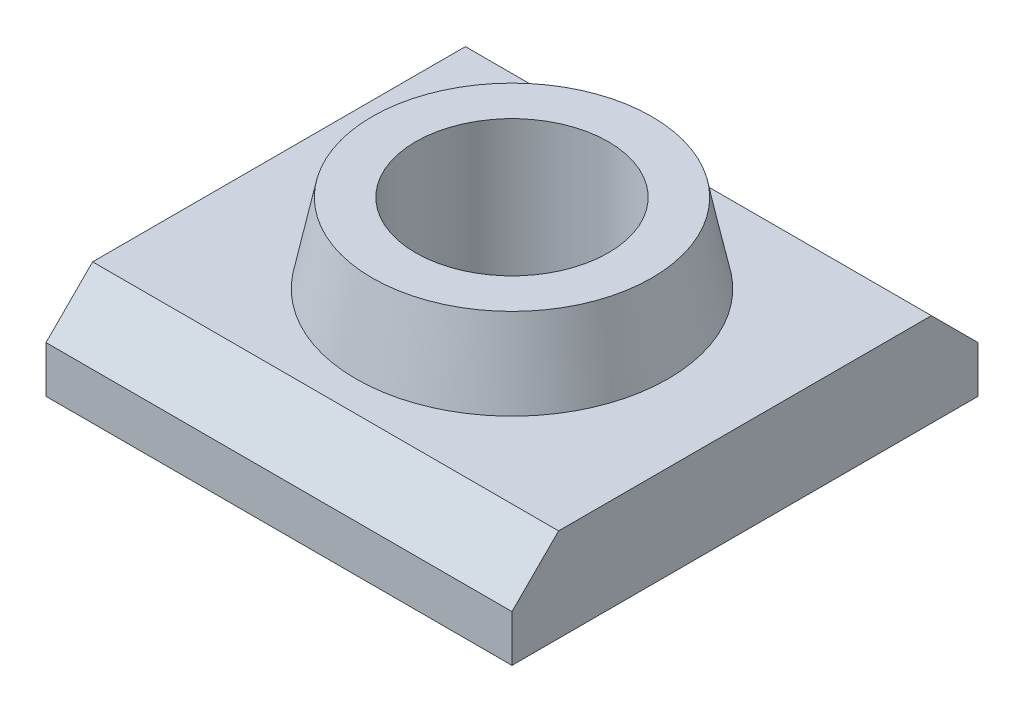
ISO-10303-21;
HEADER;
FILE_DESCRIPTION(('STEP AP214'),'2;1');
FILE_NAME('part.step','',(''),(''),'','','');
FILE_SCHEMA(('AUTOMOTIVE_DESIGN { 1 0 10303 214 1 1 1 1 }'));
ENDSEC;
DATA;
#1=APPLICATION_CONTEXT('core data for automotive mechanical design processes');
#2=APPLICATION_PROTOCOL_DEFINITION('international standard','automotive_design',2000,#1);
#3=PRODUCT_CONTEXT('',#1,'mechanical');
#4=PRODUCT('Part','Part','',(#3));
#5=PRODUCT_RELATED_PRODUCT_CATEGORY('part','',(#4));
#6=PRODUCT_DEFINITION_FORMATION('','',#4);
#7=PRODUCT_DEFINITION_CONTEXT('part definition',#1,'design');
#8=PRODUCT_DEFINITION('design','',#6,#7);
#9=PRODUCT_DEFINITION_SHAPE('','',#8);
#10=(LENGTH_UNIT() NAMED_UNIT(*) SI_UNIT(.MILLI.,.METRE.));
#11=(NAMED_UNIT(*) PLANE_ANGLE_UNIT() SI_UNIT($,.RADIAN.));
#12=(NAMED_UNIT(*) SI_UNIT($,.STERADIAN.) SOLID_ANGLE_UNIT());
#13=UNCERTAINTY_MEASURE_WITH_UNIT(LENGTH_MEASURE(1.E-05),#10,'distance_accuracy_value','');
#14=(GEOMETRIC_REPRESENTATION_CONTEXT(3) GLOBAL_UNCERTAINTY_ASSIGNED_CONTEXT((#13)) GLOBAL_UNIT_ASSIGNED_CONTEXT((#10,
#11,#12)) REPRESENTATION_CONTEXT('',''));
#15=CARTESIAN_POINT('',(0.,0.,0.));
#16=DIRECTION('',(0.,0.,1.));
#17=DIRECTION('',(1.,0.,0.));
#18=AXIS2_PLACEMENT_3D('',#15,#16,#17);
#19=CARTESIAN_POINT('',(5.,-1.7,-4.));
#20=DIRECTION('',(0.,-1.,0.));
#21=DIRECTION('',(0.,0.,-1.));
#22=AXIS2_PLACEMENT_3D('',#19,#20,#21);
#23=PLANE('',#22);
#24=DIRECTION('',(0.,0.,1.));
#25=VECTOR('',#24,1.);
#26=CARTESIAN_POINT('',(-5.,-1.7,-4.));
#27=LINE('',#26,#25);
#28=CARTESIAN_POINT('',(-5.,-1.7,-4.));
#29=VERTEX_POINT('',#28);
#30=CARTESIAN_POINT('',(-5.,-1.7,4.));
#31=VERTEX_POINT('',#30);
#32=EDGE_CURVE('E127',#29,#31,#27,.T.);
#33=ORIENTED_EDGE('',*,*,#32,.T.);
#34=DIRECTION('',(-1.,0.,0.));
#35=VECTOR('',#34,1.);
#36=CARTESIAN_POINT('',(5.,-1.7,4.));
#37=LINE('',#36,#35);
#38=CARTESIAN_POINT('',(5.,-1.7,4.));
#39=VERTEX_POINT('',#38);
#40=EDGE_CURVE('E139',#39,#31,#37,.T.);
#41=ORIENTED_EDGE('',*,*,#40,.F.);
#42=DIRECTION('',(0.,0.,1.));
#43=VECTOR('',#42,1.);
#44=CARTESIAN_POINT('',(5.,-1.7,-4.));
#45=LINE('',#44,#43);
#46=CARTESIAN_POINT('',(5.,-1.7,-4.));
#47=VERTEX_POINT('',#46);
#48=EDGE_CURVE('E93',#47,#39,#45,.T.);
#49=ORIENTED_EDGE('',*,*,#48,.F.);
#50=DIRECTION('',(-1.,0.,0.));
#51=VECTOR('',#50,1.);
#52=CARTESIAN_POINT('',(5.,-1.7,-4.));
#53=LINE('',#52,#51);
#54=EDGE_CURVE('E47',#47,#29,#53,.T.);
#55=ORIENTED_EDGE('',*,*,#54,.T.);
#56=EDGE_LOOP('',(#33,#41,#49,#55));
#57=FACE_BOUND('',#56,.T.);
#58=CARTESIAN_POINT('',(0.,-1.7,0.));
#59=DIRECTION('',(0.,-1.,0.));
#60=DIRECTION('',(0.,0.,-1.));
#61=AXIS2_PLACEMENT_3D('',#58,#59,#60);
#62=CIRCLE('',#61,3.35);
#63=CARTESIAN_POINT('',(0.,-1.7,-3.35));
#64=VERTEX_POINT('',#63);
#65=EDGE_CURVE('E11',#64,#64,#62,.F.);
#66=ORIENTED_EDGE('',*,*,#65,.F.);
#67=EDGE_LOOP('',(#66));
#68=FACE_BOUND('',#67,.T.);
#69=ADVANCED_FACE('F38',(#57,#68),#23,.F.);
#70=CARTESIAN_POINT('',(5.,-2.7,-5.));
#71=DIRECTION('',(0.,-0.707106781186547,0.707106781186548));
#72=DIRECTION('',(0.,-0.707106781186548,-0.707106781186547));
#73=AXIS2_PLACEMENT_3D('',#70,#71,#72);
#74=PLANE('',#73);
#75=DIRECTION('',(0.,0.707106781186548,0.707106781186547));
#76=VECTOR('',#75,1.);
#77=CARTESIAN_POINT('',(-5.,-2.7,-5.));
#78=LINE('',#77,#76);
#79=CARTESIAN_POINT('',(-5.,-2.7,-5.));
#80=VERTEX_POINT('',#79);
#81=EDGE_CURVE('E124',#80,#29,#78,.T.);
#82=ORIENTED_EDGE('',*,*,#81,.T.);
#83=ORIENTED_EDGE('',*,*,#54,.F.);
#84=DIRECTION('',(0.,0.707106781186548,0.707106781186547));
#85=VECTOR('',#84,1.);
#86=CARTESIAN_POINT('',(5.,-2.7,-5.));
#87=LINE('',#86,#85);
#88=CARTESIAN_POINT('',(5.,-2.7,-5.));
#89=VERTEX_POINT('',#88);
#90=EDGE_CURVE('E135',#89,#47,#87,.T.);
#91=ORIENTED_EDGE('',*,*,#90,.F.);
#92=DIRECTION('',(-1.,0.,0.));
#93=VECTOR('',#92,1.);
#94=CARTESIAN_POINT('',(5.,-2.7,-5.));
#95=LINE('',#94,#93);
#96=EDGE_CURVE('E120',#89,#80,#95,.T.);
#97=ORIENTED_EDGE('',*,*,#96,.T.);
#98=EDGE_LOOP('',(#82,#83,#91,#97));
#99=FACE_BOUND('',#98,.T.);
#100=ADVANCED_FACE('F40',(#99),#74,.F.);
#101=CARTESIAN_POINT('',(5.,-1.7,4.));
#102=DIRECTION('',(0.,-0.707106781186547,-0.707106781186548));
#103=DIRECTION('',(0.,0.707106781186548,-0.707106781186547));
#104=AXIS2_PLACEMENT_3D('',#101,#102,#103);
#105=PLANE('',#104);
#106=DIRECTION('',(0.,-0.707106781186548,0.707106781186547));
#107=VECTOR('',#106,1.);
#108=CARTESIAN_POINT('',(-5.,-1.7,4.));
#109=LINE('',#108,#107);
#110=CARTESIAN_POINT('',(-5.,-2.7,5.));
#111=VERTEX_POINT('',#110);
#112=EDGE_CURVE('E130',#31,#111,#109,.T.);
#113=ORIENTED_EDGE('',*,*,#112,.T.);
#114=DIRECTION('',(-1.,0.,0.));
#115=VECTOR('',#114,1.);
#116=CARTESIAN_POINT('',(5.,-2.7,5.));
#117=LINE('',#116,#115);
#118=CARTESIAN_POINT('',(5.,-2.7,5.));
#119=VERTEX_POINT('',#118);
#120=EDGE_CURVE('E115',#119,#111,#117,.T.);
#121=ORIENTED_EDGE('',*,*,#120,.F.);
#122=DIRECTION('',(0.,-0.707106781186548,0.707106781186547));
#123=VECTOR('',#122,1.);
#124=CARTESIAN_POINT('',(5.,-1.7,4.));
#125=LINE('',#124,#123);
#126=EDGE_CURVE('E106',#39,#119,#125,.T.);
#127=ORIENTED_EDGE('',*,*,#126,.F.);
#128=ORIENTED_EDGE('',*,*,#40,.T.);
#129=EDGE_LOOP('',(#113,#121,#127,#128));
#130=FACE_BOUND('',#129,.T.);
#131=ADVANCED_FACE('F150',(#130),#105,.F.);
#132=CARTESIAN_POINT('',(5.,-2.7,5.));
#133=DIRECTION('',(0.,0.,-1.));
#134=DIRECTION('',(0.,1.,0.));
#135=AXIS2_PLACEMENT_3D('',#132,#133,#134);
#136=PLANE('',#135);
#137=DIRECTION('',(0.,-1.,0.));
#138=VECTOR('',#137,1.);
#139=CARTESIAN_POINT('',(-5.,-2.7,5.));
#140=LINE('',#139,#138);
#141=CARTESIAN_POINT('',(-5.,-3.7,5.));
#142=VERTEX_POINT('',#141);
#143=EDGE_CURVE('E114',#111,#142,#140,.T.);
#144=ORIENTED_EDGE('',*,*,#143,.T.);
#145=DIRECTION('',(-1.,0.,0.));
#146=VECTOR('',#145,1.);
#147=CARTESIAN_POINT('',(5.,-3.7,5.));
#148=LINE('',#147,#146);
#149=CARTESIAN_POINT('',(5.,-3.7,5.));
#150=VERTEX_POINT('',#149);
#151=EDGE_CURVE('E111',#150,#142,#148,.T.);
#152=ORIENTED_EDGE('',*,*,#151,.F.);
#153=DIRECTION('',(0.,-1.,0.));
#154=VECTOR('',#153,1.);
#155=CARTESIAN_POINT('',(5.,-2.7,5.));
#156=LINE('',#155,#154);
#157=EDGE_CURVE('E100',#119,#150,#156,.T.);
#158=ORIENTED_EDGE('',*,*,#157,.F.);
#159=ORIENTED_EDGE('',*,*,#120,.T.);
#160=EDGE_LOOP('',(#144,#152,#158,#159));
#161=FACE_BOUND('',#160,.T.);
#162=ADVANCED_FACE('F112',(#161),#136,.F.);
#163=CARTESIAN_POINT('',(5.,-3.7,5.));
#164=DIRECTION('',(0.,1.,0.));
#165=DIRECTION('',(0.,0.,1.));
#166=AXIS2_PLACEMENT_3D('',#163,#164,#165);
#167=PLANE('',#166);
#168=CARTESIAN_POINT('',(0.,-3.7,0.));
#169=DIRECTION('',(0.,1.,0.));
#170=DIRECTION('',(0.,0.,1.));
#171=AXIS2_PLACEMENT_3D('',#168,#169,#170);
#172=CIRCLE('',#171,2.067);
#173=CARTESIAN_POINT('',(0.,-3.7,2.067));
#174=VERTEX_POINT('',#173);
#175=EDGE_CURVE('E156',#174,#174,#172,.T.);
#176=ORIENTED_EDGE('',*,*,#175,.T.);
#177=EDGE_LOOP('',(#176));
#178=FACE_BOUND('',#177,.T.);
#179=DIRECTION('',(0.,0.,-1.));
#180=VECTOR('',#179,1.);
#181=CARTESIAN_POINT('',(-5.,-3.7,5.));
#182=LINE('',#181,#180);
#183=CARTESIAN_POINT('',(-5.,-3.7,-5.));
#184=VERTEX_POINT('',#183);
#185=EDGE_CURVE('E78',#142,#184,#182,.T.);
#186=ORIENTED_EDGE('',*,*,#185,.T.);
#187=DIRECTION('',(-1.,0.,0.));
#188=VECTOR('',#187,1.);
#189=CARTESIAN_POINT('',(5.,-3.7,-5.));
#190=LINE('',#189,#188);
#191=CARTESIAN_POINT('',(5.,-3.7,-5.));
#192=VERTEX_POINT('',#191);
#193=EDGE_CURVE('E116',#192,#184,#190,.T.);
#194=ORIENTED_EDGE('',*,*,#193,.F.);
#195=DIRECTION('',(0.,0.,-1.));
#196=VECTOR('',#195,1.);
#197=CARTESIAN_POINT('',(5.,-3.7,5.));
#198=LINE('',#197,#196);
#199=EDGE_CURVE('E104',#150,#192,#198,.T.);
#200=ORIENTED_EDGE('',*,*,#199,.F.);
#201=ORIENTED_EDGE('',*,*,#151,.T.);
#202=EDGE_LOOP('',(#186,#194,#200,#201));
#203=FACE_BOUND('',#202,.T.);
#204=ADVANCED_FACE('F118',(#178,#203),#167,.F.);
#205=CARTESIAN_POINT('',(5.,-3.7,-5.));
#206=DIRECTION('',(0.,0.,1.));
#207=DIRECTION('',(0.,-1.,0.));
#208=AXIS2_PLACEMENT_3D('',#205,#206,#207);
#209=PLANE('',#208);
#210=DIRECTION('',(0.,1.,0.));
#211=VECTOR('',#210,1.);
#212=CARTESIAN_POINT('',(-5.,-3.7,-5.));
#213=LINE('',#212,#211);
#214=EDGE_CURVE('E84',#184,#80,#213,.T.);
#215=ORIENTED_EDGE('',*,*,#214,.T.);
#216=ORIENTED_EDGE('',*,*,#96,.F.);
#217=DIRECTION('',(0.,1.,0.));
#218=VECTOR('',#217,1.);
#219=CARTESIAN_POINT('',(5.,-3.7,-5.));
#220=LINE('',#219,#218);
#221=EDGE_CURVE('E55',#192,#89,#220,.T.);
#222=ORIENTED_EDGE('',*,*,#221,.F.);
#223=ORIENTED_EDGE('',*,*,#193,.T.);
#224=EDGE_LOOP('',(#215,#216,#222,#223));
#225=FACE_BOUND('',#224,.T.);
#226=ADVANCED_FACE('F187',(#225),#209,.F.);
#227=CARTESIAN_POINT('',(5.,0.,0.));
#228=DIRECTION('',(1.,0.,0.));
#229=DIRECTION('',(0.,0.,-1.));
#230=AXIS2_PLACEMENT_3D('',#227,#228,#229);
#231=PLANE('',#230);
#232=ORIENTED_EDGE('',*,*,#90,.T.);
#233=ORIENTED_EDGE('',*,*,#48,.T.);
#234=ORIENTED_EDGE('',*,*,#126,.T.);
#235=ORIENTED_EDGE('',*,*,#157,.T.);
#236=ORIENTED_EDGE('',*,*,#199,.T.);
#237=ORIENTED_EDGE('',*,*,#221,.T.);
#238=EDGE_LOOP('',(#232,#233,#234,#235,#236,#237));
#239=FACE_BOUND('',#238,.T.);
#240=ADVANCED_FACE('F102',(#239),#231,.T.);
#241=CARTESIAN_POINT('',(-5.,0.,0.));
#242=DIRECTION('',(1.,0.,0.));
#243=DIRECTION('',(0.,0.,-1.));
#244=AXIS2_PLACEMENT_3D('',#241,#242,#243);
#245=PLANE('',#244);
#246=ORIENTED_EDGE('',*,*,#81,.F.);
#247=ORIENTED_EDGE('',*,*,#214,.F.);
#248=ORIENTED_EDGE('',*,*,#185,.F.);
#249=ORIENTED_EDGE('',*,*,#143,.F.);
#250=ORIENTED_EDGE('',*,*,#112,.F.);
#251=ORIENTED_EDGE('',*,*,#32,.F.);
#252=EDGE_LOOP('',(#246,#247,#248,#249,#250,#251));
#253=FACE_BOUND('',#252,.T.);
#254=ADVANCED_FACE('F147',(#253),#245,.F.);
#255=CARTESIAN_POINT('',(0.,0.,-3.));
#256=DIRECTION('',(0.,-1.,0.));
#257=DIRECTION('',(0.,0.,-1.));
#258=AXIS2_PLACEMENT_3D('',#255,#256,#257);
#259=PLANE('',#258);
#260=CARTESIAN_POINT('',(0.,0.,0.));
#261=DIRECTION('',(0.,1.,0.));
#262=DIRECTION('',(0.,0.,1.));
#263=AXIS2_PLACEMENT_3D('',#260,#261,#262);
#264=CIRCLE('',#263,2.067);
#265=CARTESIAN_POINT('',(0.,0.,2.067));
#266=VERTEX_POINT('',#265);
#267=EDGE_CURVE('E159',#266,#266,#264,.T.);
#268=ORIENTED_EDGE('',*,*,#267,.F.);
#269=EDGE_LOOP('',(#268));
#270=FACE_BOUND('',#269,.T.);
#271=CARTESIAN_POINT('',(0.,0.,0.));
#272=DIRECTION('',(0.,1.,0.));
#273=DIRECTION('',(0.,0.,1.));
#274=AXIS2_PLACEMENT_3D('',#271,#272,#273);
#275=CIRCLE('',#274,3.);
#276=CARTESIAN_POINT('',(0.,0.,3.));
#277=VERTEX_POINT('',#276);
#278=EDGE_CURVE('E128',#277,#277,#275,.T.);
#279=ORIENTED_EDGE('',*,*,#278,.T.);
#280=EDGE_LOOP('',(#279));
#281=FACE_BOUND('',#280,.T.);
#282=ADVANCED_FACE('F165',(#270,#281),#259,.F.);
#283=CARTESIAN_POINT('',(0.,-1.7,0.));
#284=DIRECTION('',(0.,-1.,0.));
#285=DIRECTION('',(0.,0.,-1.));
#286=AXIS2_PLACEMENT_3D('',#283,#284,#285);
#287=CONICAL_SURFACE('',#286,3.35,0.203045217253465);
#288=ORIENTED_EDGE('',*,*,#278,.F.);
#289=EDGE_LOOP('',(#288));
#290=FACE_BOUND('',#289,.T.);
#291=ORIENTED_EDGE('',*,*,#65,.T.);
#292=EDGE_LOOP('',(#291));
#293=FACE_BOUND('',#292,.T.);
#294=ADVANCED_FACE('F168',(#290,#293),#287,.T.);
#295=CARTESIAN_POINT('',(0.,0.,0.));
#296=DIRECTION('',(0.,1.,0.));
#297=DIRECTION('',(0.,0.,1.));
#298=AXIS2_PLACEMENT_3D('',#295,#296,#297);
#299=CYLINDRICAL_SURFACE('',#298,2.067);
#300=ORIENTED_EDGE('',*,*,#175,.F.);
#301=EDGE_LOOP('',(#300));
#302=FACE_BOUND('',#301,.T.);
#303=ORIENTED_EDGE('',*,*,#267,.T.);
#304=EDGE_LOOP('',(#303));
#305=FACE_BOUND('',#304,.T.);
#306=ADVANCED_FACE('F163',(#302,#305),#299,.F.);
#307=CLOSED_SHELL('',(#69,#100,#131,#162,#204,#226,#240,#254,#282,#294,#306));
#308=MANIFOLD_SOLID_BREP('B2',#307);
#309=ADVANCED_BREP_SHAPE_REPRESENTATION('',(#18,#308),#14);
#310=SHAPE_DEFINITION_REPRESENTATION(#9,#309);
ENDSEC;
END-ISO-10303-21;
